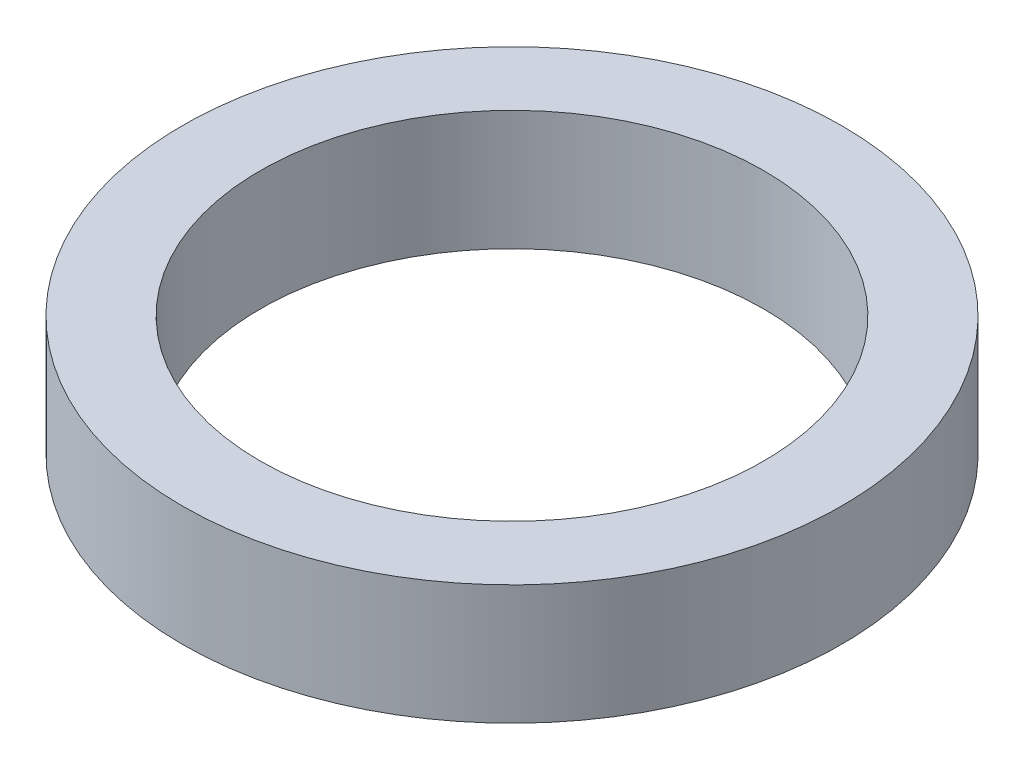
ISO-10303-21;
HEADER;
FILE_DESCRIPTION(('STEP AP214'),'2;1');
FILE_NAME('part.step','',(''),(''),'','','');
FILE_SCHEMA(('AUTOMOTIVE_DESIGN { 1 0 10303 214 1 1 1 1 }'));
ENDSEC;
DATA;
#1=APPLICATION_CONTEXT('core data for automotive mechanical design processes');
#2=APPLICATION_PROTOCOL_DEFINITION('international standard','automotive_design',2000,#1);
#3=PRODUCT_CONTEXT('',#1,'mechanical');
#4=PRODUCT('Part','Part','',(#3));
#5=PRODUCT_RELATED_PRODUCT_CATEGORY('part','',(#4));
#6=PRODUCT_DEFINITION_FORMATION('','',#4);
#7=PRODUCT_DEFINITION_CONTEXT('part definition',#1,'design');
#8=PRODUCT_DEFINITION('design','',#6,#7);
#9=PRODUCT_DEFINITION_SHAPE('','',#8);
#10=(LENGTH_UNIT() NAMED_UNIT(*) SI_UNIT(.MILLI.,.METRE.));
#11=(NAMED_UNIT(*) PLANE_ANGLE_UNIT() SI_UNIT($,.RADIAN.));
#12=(NAMED_UNIT(*) SI_UNIT($,.STERADIAN.) SOLID_ANGLE_UNIT());
#13=UNCERTAINTY_MEASURE_WITH_UNIT(LENGTH_MEASURE(1.E-05),#10,'distance_accuracy_value','');
#14=(GEOMETRIC_REPRESENTATION_CONTEXT(3) GLOBAL_UNCERTAINTY_ASSIGNED_CONTEXT((#13)) GLOBAL_UNIT_ASSIGNED_CONTEXT((#10,
#11,#12)) REPRESENTATION_CONTEXT('',''));
#15=CARTESIAN_POINT('',(0.,0.,0.));
#16=DIRECTION('',(0.,0.,1.));
#17=DIRECTION('',(1.,0.,0.));
#18=AXIS2_PLACEMENT_3D('',#15,#16,#17);
#19=CARTESIAN_POINT('',(0.,2.,0.));
#20=DIRECTION('',(0.,1.,0.));
#21=DIRECTION('',(0.,0.,1.));
#22=AXIS2_PLACEMENT_3D('',#19,#20,#21);
#23=PLANE('',#22);
#24=CARTESIAN_POINT('',(0.,2.,0.));
#25=DIRECTION('',(0.,1.,0.));
#26=DIRECTION('',(0.,0.,1.));
#27=AXIS2_PLACEMENT_3D('',#24,#25,#26);
#28=CIRCLE('',#27,5.5);
#29=CARTESIAN_POINT('',(0.,2.,5.5));
#30=VERTEX_POINT('',#29);
#31=EDGE_CURVE('E10',#30,#30,#28,.T.);
#32=ORIENTED_EDGE('',*,*,#31,.T.);
#33=EDGE_LOOP('',(#32));
#34=FACE_BOUND('',#33,.T.);
#35=CARTESIAN_POINT('',(0.,2.,0.));
#36=DIRECTION('',(0.,1.,0.));
#37=DIRECTION('',(0.,0.,1.));
#38=AXIS2_PLACEMENT_3D('',#35,#36,#37);
#39=CIRCLE('',#38,4.2);
#40=CARTESIAN_POINT('',(0.,2.,4.2));
#41=VERTEX_POINT('',#40);
#42=EDGE_CURVE('E50',#41,#41,#39,.T.);
#43=ORIENTED_EDGE('',*,*,#42,.F.);
#44=EDGE_LOOP('',(#43));
#45=FACE_BOUND('',#44,.T.);
#46=ADVANCED_FACE('F37',(#34,#45),#23,.T.);
#47=CARTESIAN_POINT('',(0.,0.,0.));
#48=DIRECTION('',(0.,1.,0.));
#49=DIRECTION('',(0.,0.,1.));
#50=AXIS2_PLACEMENT_3D('',#47,#48,#49);
#51=PLANE('',#50);
#52=CARTESIAN_POINT('',(0.,0.,0.));
#53=DIRECTION('',(0.,1.,0.));
#54=DIRECTION('',(0.,0.,1.));
#55=AXIS2_PLACEMENT_3D('',#52,#53,#54);
#56=CIRCLE('',#55,5.5);
#57=CARTESIAN_POINT('',(0.,0.,5.5));
#58=VERTEX_POINT('',#57);
#59=EDGE_CURVE('E41',#58,#58,#56,.T.);
#60=ORIENTED_EDGE('',*,*,#59,.F.);
#61=EDGE_LOOP('',(#60));
#62=FACE_BOUND('',#61,.T.);
#63=CARTESIAN_POINT('',(0.,0.,0.));
#64=DIRECTION('',(0.,1.,0.));
#65=DIRECTION('',(0.,0.,1.));
#66=AXIS2_PLACEMENT_3D('',#63,#64,#65);
#67=CIRCLE('',#66,4.2);
#68=CARTESIAN_POINT('',(0.,0.,4.2));
#69=VERTEX_POINT('',#68);
#70=EDGE_CURVE('E52',#69,#69,#67,.T.);
#71=ORIENTED_EDGE('',*,*,#70,.T.);
#72=EDGE_LOOP('',(#71));
#73=FACE_BOUND('',#72,.T.);
#74=ADVANCED_FACE('F64',(#62,#73),#51,.F.);
#75=CARTESIAN_POINT('',(0.,2.,0.));
#76=DIRECTION('',(0.,-1.,0.));
#77=DIRECTION('',(0.,0.,-1.));
#78=AXIS2_PLACEMENT_3D('',#75,#76,#77);
#79=CYLINDRICAL_SURFACE('',#78,5.5);
#80=ORIENTED_EDGE('',*,*,#31,.F.);
#81=EDGE_LOOP('',(#80));
#82=FACE_BOUND('',#81,.T.);
#83=ORIENTED_EDGE('',*,*,#59,.T.);
#84=EDGE_LOOP('',(#83));
#85=FACE_BOUND('',#84,.T.);
#86=ADVANCED_FACE('F39',(#82,#85),#79,.T.);
#87=CARTESIAN_POINT('',(0.,2.,0.));
#88=DIRECTION('',(0.,-1.,0.));
#89=DIRECTION('',(0.,0.,-1.));
#90=AXIS2_PLACEMENT_3D('',#87,#88,#89);
#91=CYLINDRICAL_SURFACE('',#90,4.2);
#92=ORIENTED_EDGE('',*,*,#42,.T.);
#93=EDGE_LOOP('',(#92));
#94=FACE_BOUND('',#93,.T.);
#95=ORIENTED_EDGE('',*,*,#70,.F.);
#96=EDGE_LOOP('',(#95));
#97=FACE_BOUND('',#96,.T.);
#98=ADVANCED_FACE('F60',(#94,#97),#91,.F.);
#99=CLOSED_SHELL('',(#46,#74,#86,#98));
#100=MANIFOLD_SOLID_BREP('B2',#99);
#101=ADVANCED_BREP_SHAPE_REPRESENTATION('',(#18,#100),#14);
#102=SHAPE_DEFINITION_REPRESENTATION(#9,#101);
ENDSEC;
END-ISO-10303-21;
